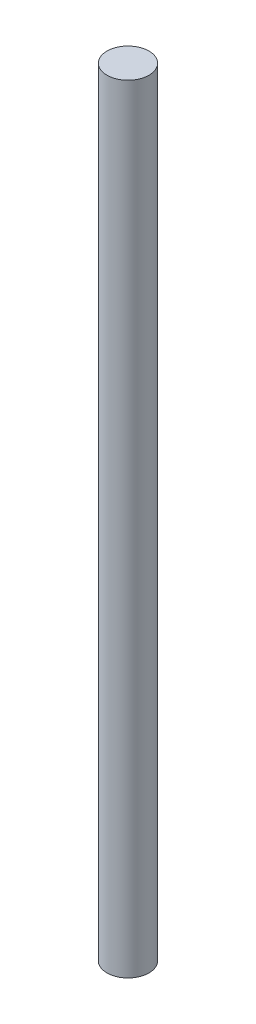
ISO-10303-21;
HEADER;
FILE_DESCRIPTION(('STEP AP214'),'2;1');
FILE_NAME('part.step','',(''),(''),'','','');
FILE_SCHEMA(('AUTOMOTIVE_DESIGN { 1 0 10303 214 1 1 1 1 }'));
ENDSEC;
DATA;
#1=APPLICATION_CONTEXT('core data for automotive mechanical design processes');
#2=APPLICATION_PROTOCOL_DEFINITION('international standard','automotive_design',2000,#1);
#3=PRODUCT_CONTEXT('',#1,'mechanical');
#4=PRODUCT('Part','Part','',(#3));
#5=PRODUCT_RELATED_PRODUCT_CATEGORY('part','',(#4));
#6=PRODUCT_DEFINITION_FORMATION('','',#4);
#7=PRODUCT_DEFINITION_CONTEXT('part definition',#1,'design');
#8=PRODUCT_DEFINITION('design','',#6,#7);
#9=PRODUCT_DEFINITION_SHAPE('','',#8);
#10=(LENGTH_UNIT() NAMED_UNIT(*) SI_UNIT(.MILLI.,.METRE.));
#11=(NAMED_UNIT(*) PLANE_ANGLE_UNIT() SI_UNIT($,.RADIAN.));
#12=(NAMED_UNIT(*) SI_UNIT($,.STERADIAN.) SOLID_ANGLE_UNIT());
#13=UNCERTAINTY_MEASURE_WITH_UNIT(LENGTH_MEASURE(1.E-05),#10,'distance_accuracy_value','');
#14=(GEOMETRIC_REPRESENTATION_CONTEXT(3) GLOBAL_UNCERTAINTY_ASSIGNED_CONTEXT((#13)) GLOBAL_UNIT_ASSIGNED_CONTEXT((#10,
#11,#12)) REPRESENTATION_CONTEXT('',''));
#15=CARTESIAN_POINT('',(0.,0.,0.));
#16=DIRECTION('',(0.,0.,1.));
#17=DIRECTION('',(1.,0.,0.));
#18=AXIS2_PLACEMENT_3D('',#15,#16,#17);
#19=CARTESIAN_POINT('',(0.,148.26,0.));
#20=DIRECTION('',(0.,-1.,0.));
#21=DIRECTION('',(0.,0.,-1.));
#22=AXIS2_PLACEMENT_3D('',#19,#20,#21);
#23=CYLINDRICAL_SURFACE('',#22,4.);
#24=CARTESIAN_POINT('',(0.,148.26,0.));
#25=DIRECTION('',(0.,1.,0.));
#26=DIRECTION('',(0.,0.,1.));
#27=AXIS2_PLACEMENT_3D('',#24,#25,#26);
#28=CIRCLE('',#27,4.);
#29=CARTESIAN_POINT('',(0.,148.26,4.));
#30=VERTEX_POINT('',#29);
#31=EDGE_CURVE('E10',#30,#30,#28,.T.);
#32=ORIENTED_EDGE('',*,*,#31,.F.);
#33=EDGE_LOOP('',(#32));
#34=FACE_BOUND('',#33,.T.);
#35=CARTESIAN_POINT('',(0.,0.,0.));
#36=DIRECTION('',(0.,1.,0.));
#37=DIRECTION('',(0.,0.,1.));
#38=AXIS2_PLACEMENT_3D('',#35,#36,#37);
#39=CIRCLE('',#38,4.);
#40=CARTESIAN_POINT('',(0.,0.,4.));
#41=VERTEX_POINT('',#40);
#42=EDGE_CURVE('E34',#41,#41,#39,.T.);
#43=ORIENTED_EDGE('',*,*,#42,.T.);
#44=EDGE_LOOP('',(#43));
#45=FACE_BOUND('',#44,.T.);
#46=ADVANCED_FACE('F31',(#34,#45),#23,.T.);
#47=CARTESIAN_POINT('',(0.,148.26,0.));
#48=DIRECTION('',(0.,1.,0.));
#49=DIRECTION('',(0.,0.,1.));
#50=AXIS2_PLACEMENT_3D('',#47,#48,#49);
#51=PLANE('',#50);
#52=ORIENTED_EDGE('',*,*,#31,.T.);
#53=EDGE_LOOP('',(#52));
#54=FACE_BOUND('',#53,.T.);
#55=ADVANCED_FACE('F46',(#54),#51,.T.);
#56=CARTESIAN_POINT('',(0.,0.,0.));
#57=DIRECTION('',(0.,1.,0.));
#58=DIRECTION('',(0.,0.,1.));
#59=AXIS2_PLACEMENT_3D('',#56,#57,#58);
#60=PLANE('',#59);
#61=ORIENTED_EDGE('',*,*,#42,.F.);
#62=EDGE_LOOP('',(#61));
#63=FACE_BOUND('',#62,.T.);
#64=ADVANCED_FACE('F44',(#63),#60,.F.);
#65=CLOSED_SHELL('',(#46,#55,#64));
#66=MANIFOLD_SOLID_BREP('B2',#65);
#67=ADVANCED_BREP_SHAPE_REPRESENTATION('',(#18,#66),#14);
#68=SHAPE_DEFINITION_REPRESENTATION(#9,#67);
ENDSEC;
END-ISO-10303-21;
